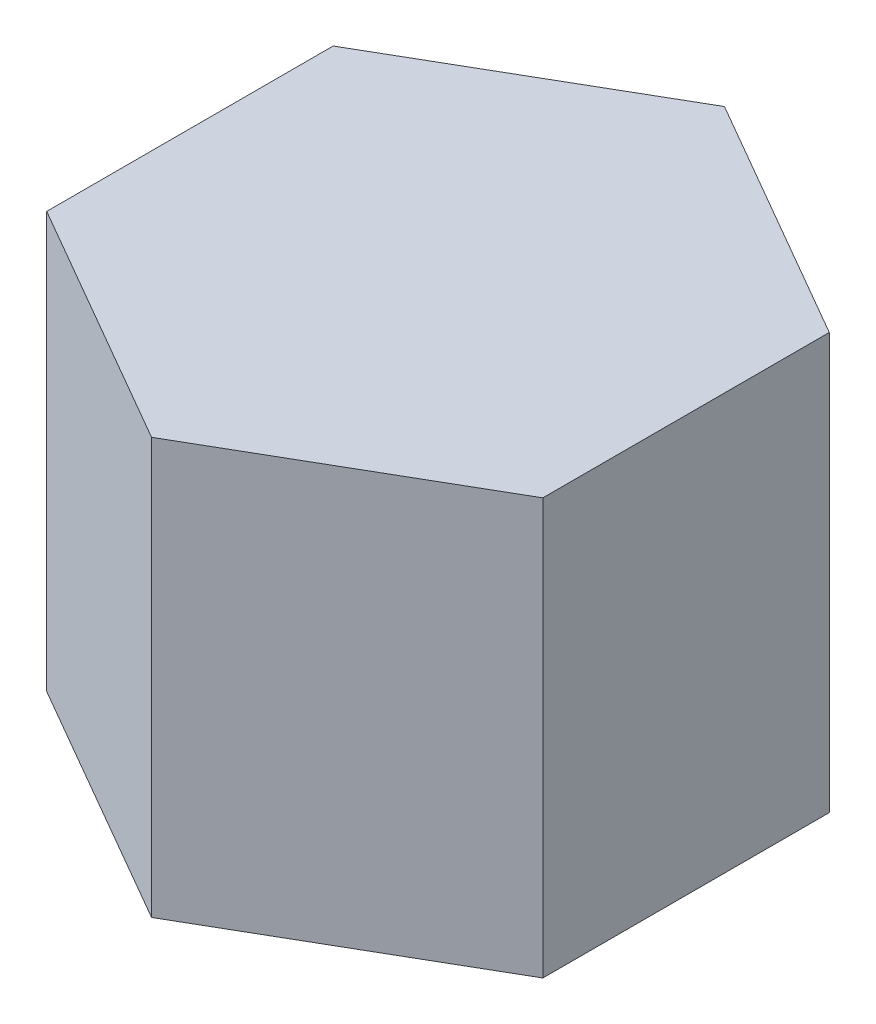
ISO-10303-21;
HEADER;
FILE_DESCRIPTION(('STEP AP214'),'2;1');
FILE_NAME('part.step','',(''),(''),'','','');
FILE_SCHEMA(('AUTOMOTIVE_DESIGN { 1 0 10303 214 1 1 1 1 }'));
ENDSEC;
DATA;
#1=APPLICATION_CONTEXT('core data for automotive mechanical design processes');
#2=APPLICATION_PROTOCOL_DEFINITION('international standard','automotive_design',2000,#1);
#3=PRODUCT_CONTEXT('',#1,'mechanical');
#4=PRODUCT('Part','Part','',(#3));
#5=PRODUCT_RELATED_PRODUCT_CATEGORY('part','',(#4));
#6=PRODUCT_DEFINITION_FORMATION('','',#4);
#7=PRODUCT_DEFINITION_CONTEXT('part definition',#1,'design');
#8=PRODUCT_DEFINITION('design','',#6,#7);
#9=PRODUCT_DEFINITION_SHAPE('','',#8);
#10=(LENGTH_UNIT() NAMED_UNIT(*) SI_UNIT(.MILLI.,.METRE.));
#11=(NAMED_UNIT(*) PLANE_ANGLE_UNIT() SI_UNIT($,.RADIAN.));
#12=(NAMED_UNIT(*) SI_UNIT($,.STERADIAN.) SOLID_ANGLE_UNIT());
#13=UNCERTAINTY_MEASURE_WITH_UNIT(LENGTH_MEASURE(1.E-05),#10,'distance_accuracy_value','');
#14=(GEOMETRIC_REPRESENTATION_CONTEXT(3) GLOBAL_UNCERTAINTY_ASSIGNED_CONTEXT((#13)) GLOBAL_UNIT_ASSIGNED_CONTEXT((#10,
#11,#12)) REPRESENTATION_CONTEXT('',''));
#15=CARTESIAN_POINT('',(0.,0.,0.));
#16=DIRECTION('',(0.,0.,1.));
#17=DIRECTION('',(1.,0.,0.));
#18=AXIS2_PLACEMENT_3D('',#15,#16,#17);
#19=CARTESIAN_POINT('',(208.142660308706,-148.537700895744,290.64094581671));
#20=DIRECTION('',(-0.499999999999909,0.,-0.866025403784491));
#21=DIRECTION('',(-0.866025403784491,0.,0.499999999999909));
#22=AXIS2_PLACEMENT_3D('',#19,#20,#21);
#23=PLANE('',#22);
#24=CARTESIAN_POINT('',(207.839551417382,-149.045793579175,290.81594581671));
#25=DIRECTION('',(0.866025403784491,0.,-0.499999999999909));
#26=VECTOR('',#25,1.);
#27=LINE('',#24,#26);
#28=CARTESIAN_POINT('',(207.839551417382,-149.045793579175,290.81594581671));
#29=VERTEX_POINT('',#28);
#30=CARTESIAN_POINT('',(208.142660308706,-149.045793579175,290.64094581671));
#31=VERTEX_POINT('',#30);
#32=EDGE_CURVE('E170',#29,#31,#27,.T.);
#33=ORIENTED_EDGE('',*,*,#32,.T.);
#34=CARTESIAN_POINT('',(208.142660308706,-148.537700895744,290.64094581671));
#35=DIRECTION('',(0.,-1.,0.));
#36=VECTOR('',#35,1.);
#37=LINE('',#34,#36);
#38=CARTESIAN_POINT('',(208.142660308706,-148.537700895744,290.64094581671));
#39=VERTEX_POINT('',#38);
#40=EDGE_CURVE('E35',#39,#31,#37,.T.);
#41=ORIENTED_EDGE('',*,*,#40,.F.);
#42=CARTESIAN_POINT('',(207.839551417382,-148.537700895744,290.81594581671));
#43=DIRECTION('',(0.866025403784491,0.,-0.499999999999909));
#44=VECTOR('',#43,1.);
#45=LINE('',#42,#44);
#46=CARTESIAN_POINT('',(207.839551417382,-148.537700895744,290.81594581671));
#47=VERTEX_POINT('',#46);
#48=EDGE_CURVE('E159',#47,#39,#45,.T.);
#49=ORIENTED_EDGE('',*,*,#48,.F.);
#50=CARTESIAN_POINT('',(207.839551417382,-148.537700895744,290.81594581671));
#51=DIRECTION('',(0.,-1.,0.));
#52=VECTOR('',#51,1.);
#53=LINE('',#50,#52);
#54=EDGE_CURVE('E10',#47,#29,#53,.T.);
#55=ORIENTED_EDGE('',*,*,#54,.T.);
#56=EDGE_LOOP('',(#33,#41,#49,#55));
#57=FACE_BOUND('',#56,.T.);
#58=ADVANCED_FACE('F16',(#57),#23,.F.);
#59=CARTESIAN_POINT('',(207.839551417382,-148.537700895744,290.81594581671));
#60=DIRECTION('',(0.500000000000096,0.,-0.866025403784383));
#61=DIRECTION('',(-0.866025403784383,0.,-0.500000000000096));
#62=AXIS2_PLACEMENT_3D('',#59,#60,#61);
#63=PLANE('',#62);
#64=CARTESIAN_POINT('',(207.536442526057,-149.045793579175,290.64094581671));
#65=DIRECTION('',(0.866025403784383,0.,0.500000000000096));
#66=VECTOR('',#65,1.);
#67=LINE('',#64,#66);
#68=CARTESIAN_POINT('',(207.536442526057,-149.045793579175,290.64094581671));
#69=VERTEX_POINT('',#68);
#70=EDGE_CURVE('E167',#69,#29,#67,.T.);
#71=ORIENTED_EDGE('',*,*,#70,.T.);
#72=ORIENTED_EDGE('',*,*,#54,.F.);
#73=CARTESIAN_POINT('',(207.536442526057,-148.537700895744,290.64094581671));
#74=DIRECTION('',(0.866025403784383,0.,0.500000000000096));
#75=VECTOR('',#74,1.);
#76=LINE('',#73,#75);
#77=CARTESIAN_POINT('',(207.536442526057,-148.537700895744,290.64094581671));
#78=VERTEX_POINT('',#77);
#79=EDGE_CURVE('E156',#78,#47,#76,.T.);
#80=ORIENTED_EDGE('',*,*,#79,.F.);
#81=CARTESIAN_POINT('',(207.536442526057,-148.537700895744,290.64094581671));
#82=DIRECTION('',(0.,-1.,0.));
#83=VECTOR('',#82,1.);
#84=LINE('',#81,#83);
#85=EDGE_CURVE('E27',#78,#69,#84,.T.);
#86=ORIENTED_EDGE('',*,*,#85,.T.);
#87=EDGE_LOOP('',(#71,#72,#80,#86));
#88=FACE_BOUND('',#87,.T.);
#89=ADVANCED_FACE('F189',(#88),#63,.F.);
#90=CARTESIAN_POINT('',(207.536442526057,-148.537700895744,290.831971220494));
#91=DIRECTION('',(1.,0.,0.));
#92=DIRECTION('',(0.,1.,0.));
#93=AXIS2_PLACEMENT_3D('',#90,#91,#92);
#94=PLANE('',#93);
#95=CARTESIAN_POINT('',(207.536442526057,-149.045793579175,290.29094581671));
#96=DIRECTION('',(0.,0.,1.));
#97=VECTOR('',#96,1.);
#98=LINE('',#95,#97);
#99=CARTESIAN_POINT('',(207.536442526057,-149.045793579175,290.29094581671));
#100=VERTEX_POINT('',#99);
#101=EDGE_CURVE('E163',#100,#69,#98,.T.);
#102=ORIENTED_EDGE('',*,*,#101,.T.);
#103=ORIENTED_EDGE('',*,*,#85,.F.);
#104=CARTESIAN_POINT('',(207.536442526057,-148.537700895744,290.29094581671));
#105=DIRECTION('',(0.,0.,1.));
#106=VECTOR('',#105,1.);
#107=LINE('',#104,#106);
#108=CARTESIAN_POINT('',(207.536442526057,-148.537700895744,290.29094581671));
#109=VERTEX_POINT('',#108);
#110=EDGE_CURVE('E106',#109,#78,#107,.T.);
#111=ORIENTED_EDGE('',*,*,#110,.F.);
#112=CARTESIAN_POINT('',(207.536442526057,-148.537700895744,290.29094581671));
#113=DIRECTION('',(0.,-1.,0.));
#114=VECTOR('',#113,1.);
#115=LINE('',#112,#114);
#116=EDGE_CURVE('E94',#109,#100,#115,.T.);
#117=ORIENTED_EDGE('',*,*,#116,.T.);
#118=EDGE_LOOP('',(#102,#103,#111,#117));
#119=FACE_BOUND('',#118,.T.);
#120=ADVANCED_FACE('F198',(#119),#94,.F.);
#121=CARTESIAN_POINT('',(207.536442526057,-148.537700895744,290.29094581671));
#122=DIRECTION('',(0.499999999999943,0.,0.866025403784472));
#123=DIRECTION('',(0.866025403784472,0.,-0.499999999999943));
#124=AXIS2_PLACEMENT_3D('',#121,#122,#123);
#125=PLANE('',#124);
#126=CARTESIAN_POINT('',(207.839551417382,-149.045793579175,290.11594581671));
#127=DIRECTION('',(-0.866025403784471,0.,0.499999999999943));
#128=VECTOR('',#127,1.);
#129=LINE('',#126,#128);
#130=CARTESIAN_POINT('',(207.839551417382,-149.045793579175,290.11594581671));
#131=VERTEX_POINT('',#130);
#132=EDGE_CURVE('E162',#131,#100,#129,.T.);
#133=ORIENTED_EDGE('',*,*,#132,.T.);
#134=ORIENTED_EDGE('',*,*,#116,.F.);
#135=CARTESIAN_POINT('',(207.839551417382,-148.537700895744,290.11594581671));
#136=DIRECTION('',(-0.866025403784471,0.,0.499999999999943));
#137=VECTOR('',#136,1.);
#138=LINE('',#135,#137);
#139=CARTESIAN_POINT('',(207.839551417382,-148.537700895744,290.11594581671));
#140=VERTEX_POINT('',#139);
#141=EDGE_CURVE('E98',#140,#109,#138,.T.);
#142=ORIENTED_EDGE('',*,*,#141,.F.);
#143=CARTESIAN_POINT('',(207.839551417382,-148.537700895744,290.11594581671));
#144=DIRECTION('',(0.,-1.,0.));
#145=VECTOR('',#144,1.);
#146=LINE('',#143,#145);
#147=EDGE_CURVE('E79',#140,#131,#146,.T.);
#148=ORIENTED_EDGE('',*,*,#147,.T.);
#149=EDGE_LOOP('',(#133,#134,#142,#148));
#150=FACE_BOUND('',#149,.T.);
#151=ADVANCED_FACE('F100',(#150),#125,.F.);
#152=CARTESIAN_POINT('',(207.839551417382,-148.537700895744,290.11594581671));
#153=DIRECTION('',(-0.500000000000062,0.,0.866025403784403));
#154=DIRECTION('',(0.866025403784403,0.,0.500000000000062));
#155=AXIS2_PLACEMENT_3D('',#152,#153,#154);
#156=PLANE('',#155);
#157=CARTESIAN_POINT('',(208.142660308706,-149.045793579175,290.29094581671));
#158=DIRECTION('',(-0.866025403784403,0.,-0.500000000000062));
#159=VECTOR('',#158,1.);
#160=LINE('',#157,#159);
#161=CARTESIAN_POINT('',(208.142660308706,-149.045793579175,290.29094581671));
#162=VERTEX_POINT('',#161);
#163=EDGE_CURVE('E88',#162,#131,#160,.T.);
#164=ORIENTED_EDGE('',*,*,#163,.T.);
#165=ORIENTED_EDGE('',*,*,#147,.F.);
#166=CARTESIAN_POINT('',(208.142660308706,-148.537700895744,290.29094581671));
#167=DIRECTION('',(-0.866025403784403,0.,-0.500000000000062));
#168=VECTOR('',#167,1.);
#169=LINE('',#166,#168);
#170=CARTESIAN_POINT('',(208.142660308706,-148.537700895744,290.29094581671));
#171=VERTEX_POINT('',#170);
#172=EDGE_CURVE('E84',#171,#140,#169,.T.);
#173=ORIENTED_EDGE('',*,*,#172,.F.);
#174=CARTESIAN_POINT('',(208.142660308706,-148.537700895744,290.29094581671));
#175=DIRECTION('',(0.,-1.,0.));
#176=VECTOR('',#175,1.);
#177=LINE('',#174,#176);
#178=EDGE_CURVE('E58',#171,#162,#177,.T.);
#179=ORIENTED_EDGE('',*,*,#178,.T.);
#180=EDGE_LOOP('',(#164,#165,#173,#179));
#181=FACE_BOUND('',#180,.T.);
#182=ADVANCED_FACE('F82',(#181),#156,.F.);
#183=CARTESIAN_POINT('',(208.142660308706,-148.537700895744,290.831971220494));
#184=DIRECTION('',(-1.,0.,0.));
#185=DIRECTION('',(0.,-1.,0.));
#186=AXIS2_PLACEMENT_3D('',#183,#184,#185);
#187=PLANE('',#186);
#188=CARTESIAN_POINT('',(208.142660308706,-149.045793579175,290.64094581671));
#189=DIRECTION('',(0.,0.,-1.));
#190=VECTOR('',#189,1.);
#191=LINE('',#188,#190);
#192=EDGE_CURVE('E160',#31,#162,#191,.T.);
#193=ORIENTED_EDGE('',*,*,#192,.T.);
#194=ORIENTED_EDGE('',*,*,#178,.F.);
#195=CARTESIAN_POINT('',(208.142660308706,-148.537700895744,290.64094581671));
#196=DIRECTION('',(0.,0.,-1.));
#197=VECTOR('',#196,1.);
#198=LINE('',#195,#197);
#199=EDGE_CURVE('E112',#39,#171,#198,.T.);
#200=ORIENTED_EDGE('',*,*,#199,.F.);
#201=ORIENTED_EDGE('',*,*,#40,.T.);
#202=EDGE_LOOP('',(#193,#194,#200,#201));
#203=FACE_BOUND('',#202,.T.);
#204=ADVANCED_FACE('F131',(#203),#187,.F.);
#205=CARTESIAN_POINT('',(206.339551417382,-148.537700895744,290.831971220494));
#206=DIRECTION('',(0.,-1.,0.));
#207=DIRECTION('',(1.,0.,0.));
#208=AXIS2_PLACEMENT_3D('',#205,#206,#207);
#209=PLANE('',#208);
#210=ORIENTED_EDGE('',*,*,#48,.T.);
#211=ORIENTED_EDGE('',*,*,#199,.T.);
#212=ORIENTED_EDGE('',*,*,#172,.T.);
#213=ORIENTED_EDGE('',*,*,#141,.T.);
#214=ORIENTED_EDGE('',*,*,#110,.T.);
#215=ORIENTED_EDGE('',*,*,#79,.T.);
#216=EDGE_LOOP('',(#210,#211,#212,#213,#214,#215));
#217=FACE_BOUND('',#216,.T.);
#218=ADVANCED_FACE('F111',(#217),#209,.F.);
#219=CARTESIAN_POINT('',(206.339551417382,-149.045793579175,290.831971220494));
#220=DIRECTION('',(0.,-1.,0.));
#221=DIRECTION('',(1.,0.,0.));
#222=AXIS2_PLACEMENT_3D('',#219,#220,#221);
#223=PLANE('',#222);
#224=ORIENTED_EDGE('',*,*,#32,.F.);
#225=ORIENTED_EDGE('',*,*,#70,.F.);
#226=ORIENTED_EDGE('',*,*,#101,.F.);
#227=ORIENTED_EDGE('',*,*,#132,.F.);
#228=ORIENTED_EDGE('',*,*,#163,.F.);
#229=ORIENTED_EDGE('',*,*,#192,.F.);
#230=EDGE_LOOP('',(#224,#225,#226,#227,#228,#229));
#231=FACE_BOUND('',#230,.T.);
#232=ADVANCED_FACE('F130',(#231),#223,.T.);
#233=CLOSED_SHELL('',(#58,#89,#120,#151,#182,#204,#218,#232));
#234=MANIFOLD_SOLID_BREP('B1',#233);
#235=ADVANCED_BREP_SHAPE_REPRESENTATION('',(#18,#234),#14);
#236=SHAPE_DEFINITION_REPRESENTATION(#9,#235);
ENDSEC;
END-ISO-10303-21;
